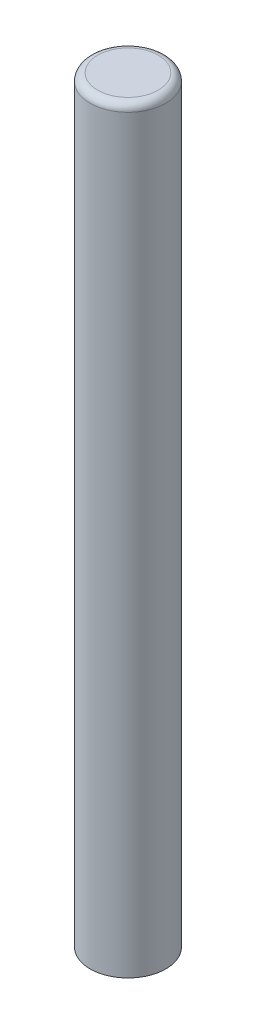
ISO-10303-21;
HEADER;
FILE_DESCRIPTION(('STEP AP214'),'2;1');
FILE_NAME('part.step','',(''),(''),'','','');
FILE_SCHEMA(('AUTOMOTIVE_DESIGN { 1 0 10303 214 1 1 1 1 }'));
ENDSEC;
DATA;
#1=APPLICATION_CONTEXT('core data for automotive mechanical design processes');
#2=APPLICATION_PROTOCOL_DEFINITION('international standard','automotive_design',2000,#1);
#3=PRODUCT_CONTEXT('',#1,'mechanical');
#4=PRODUCT('Part','Part','',(#3));
#5=PRODUCT_RELATED_PRODUCT_CATEGORY('part','',(#4));
#6=PRODUCT_DEFINITION_FORMATION('','',#4);
#7=PRODUCT_DEFINITION_CONTEXT('part definition',#1,'design');
#8=PRODUCT_DEFINITION('design','',#6,#7);
#9=PRODUCT_DEFINITION_SHAPE('','',#8);
#10=(LENGTH_UNIT() NAMED_UNIT(*) SI_UNIT(.MILLI.,.METRE.));
#11=(NAMED_UNIT(*) PLANE_ANGLE_UNIT() SI_UNIT($,.RADIAN.));
#12=(NAMED_UNIT(*) SI_UNIT($,.STERADIAN.) SOLID_ANGLE_UNIT());
#13=UNCERTAINTY_MEASURE_WITH_UNIT(LENGTH_MEASURE(1.E-05),#10,'distance_accuracy_value','');
#14=(GEOMETRIC_REPRESENTATION_CONTEXT(3) GLOBAL_UNCERTAINTY_ASSIGNED_CONTEXT((#13)) GLOBAL_UNIT_ASSIGNED_CONTEXT((#10,
#11,#12)) REPRESENTATION_CONTEXT('',''));
#15=CARTESIAN_POINT('',(0.,0.,0.));
#16=DIRECTION('',(0.,0.,1.));
#17=DIRECTION('',(1.,0.,0.));
#18=AXIS2_PLACEMENT_3D('',#15,#16,#17);
#19=CARTESIAN_POINT('',(0.,100.,0.));
#20=DIRECTION('',(0.,-1.,0.));
#21=DIRECTION('',(0.,0.,-1.));
#22=AXIS2_PLACEMENT_3D('',#19,#20,#21);
#23=CYLINDRICAL_SURFACE('',#22,5.);
#24=CARTESIAN_POINT('',(0.,99.,0.));
#25=DIRECTION('',(0.,1.,0.));
#26=DIRECTION('',(0.,0.,1.));
#27=AXIS2_PLACEMENT_3D('',#24,#25,#26);
#28=CIRCLE('',#27,5.);
#29=CARTESIAN_POINT('',(0.,99.,5.));
#30=VERTEX_POINT('',#29);
#31=EDGE_CURVE('E10',#30,#30,#28,.F.);
#32=ORIENTED_EDGE('',*,*,#31,.T.);
#33=EDGE_LOOP('',(#32));
#34=FACE_BOUND('',#33,.T.);
#35=CARTESIAN_POINT('',(0.,0.,0.));
#36=DIRECTION('',(0.,1.,0.));
#37=DIRECTION('',(0.,0.,1.));
#38=AXIS2_PLACEMENT_3D('',#35,#36,#37);
#39=CIRCLE('',#38,5.);
#40=CARTESIAN_POINT('',(0.,0.,5.));
#41=VERTEX_POINT('',#40);
#42=EDGE_CURVE('E41',#41,#41,#39,.T.);
#43=ORIENTED_EDGE('',*,*,#42,.T.);
#44=EDGE_LOOP('',(#43));
#45=FACE_BOUND('',#44,.T.);
#46=ADVANCED_FACE('F30',(#34,#45),#23,.T.);
#47=CARTESIAN_POINT('',(0.,100.,0.));
#48=DIRECTION('',(0.,1.,0.));
#49=DIRECTION('',(0.,0.,1.));
#50=AXIS2_PLACEMENT_3D('',#47,#48,#49);
#51=PLANE('',#50);
#52=CARTESIAN_POINT('',(0.,100.,0.));
#53=DIRECTION('',(0.,1.,0.));
#54=DIRECTION('',(0.,0.,1.));
#55=AXIS2_PLACEMENT_3D('',#52,#53,#54);
#56=CIRCLE('',#55,4.);
#57=CARTESIAN_POINT('',(0.,100.,4.));
#58=VERTEX_POINT('',#57);
#59=EDGE_CURVE('E37',#58,#58,#56,.T.);
#60=ORIENTED_EDGE('',*,*,#59,.T.);
#61=EDGE_LOOP('',(#60));
#62=FACE_BOUND('',#61,.T.);
#63=ADVANCED_FACE('F51',(#62),#51,.T.);
#64=CARTESIAN_POINT('',(0.,0.,0.));
#65=DIRECTION('',(0.,1.,0.));
#66=DIRECTION('',(0.,0.,1.));
#67=AXIS2_PLACEMENT_3D('',#64,#65,#66);
#68=PLANE('',#67);
#69=ORIENTED_EDGE('',*,*,#42,.F.);
#70=EDGE_LOOP('',(#69));
#71=FACE_BOUND('',#70,.T.);
#72=ADVANCED_FACE('F49',(#71),#68,.F.);
#73=CARTESIAN_POINT('',(0.,99.,0.));
#74=DIRECTION('',(0.,1.,0.));
#75=DIRECTION('',(0.,0.,1.));
#76=AXIS2_PLACEMENT_3D('',#73,#74,#75);
#77=TOROIDAL_SURFACE('',#76,4.,1.);
#78=ORIENTED_EDGE('',*,*,#31,.F.);
#79=EDGE_LOOP('',(#78));
#80=FACE_BOUND('',#79,.T.);
#81=ORIENTED_EDGE('',*,*,#59,.F.);
#82=EDGE_LOOP('',(#81));
#83=FACE_BOUND('',#82,.T.);
#84=ADVANCED_FACE('F32',(#80,#83),#77,.T.);
#85=CLOSED_SHELL('',(#46,#63,#72,#84));
#86=MANIFOLD_SOLID_BREP('B2',#85);
#87=ADVANCED_BREP_SHAPE_REPRESENTATION('',(#18,#86),#14);
#88=SHAPE_DEFINITION_REPRESENTATION(#9,#87);
ENDSEC;
END-ISO-10303-21;
